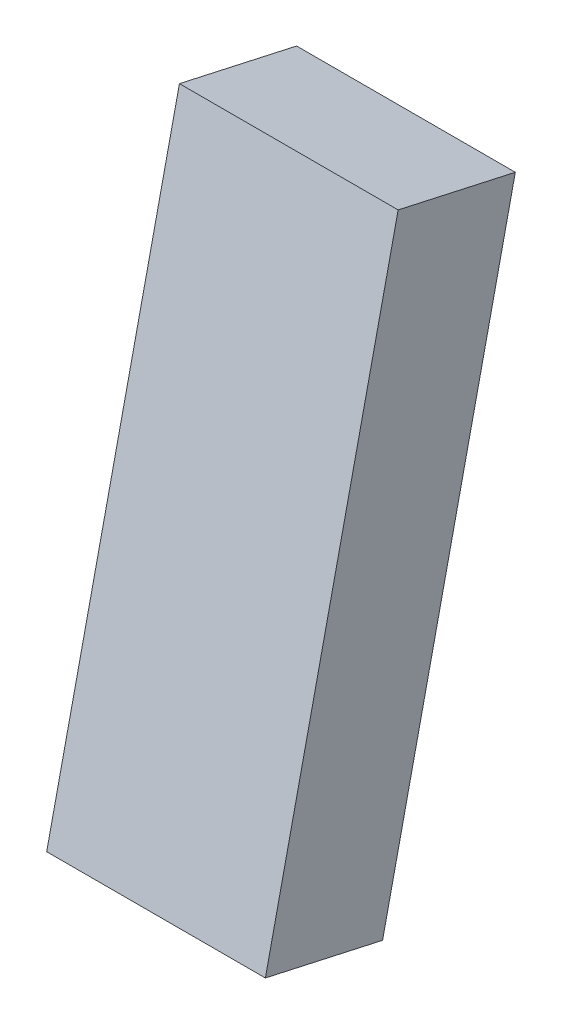
ISO-10303-21;
HEADER;
FILE_DESCRIPTION(('STEP AP214'),'2;1');
FILE_NAME('part.step','',(''),(''),'','','');
FILE_SCHEMA(('AUTOMOTIVE_DESIGN { 1 0 10303 214 1 1 1 1 }'));
ENDSEC;
DATA;
#1=APPLICATION_CONTEXT('core data for automotive mechanical design processes');
#2=APPLICATION_PROTOCOL_DEFINITION('international standard','automotive_design',2000,#1);
#3=PRODUCT_CONTEXT('',#1,'mechanical');
#4=PRODUCT('Part','Part','',(#3));
#5=PRODUCT_RELATED_PRODUCT_CATEGORY('part','',(#4));
#6=PRODUCT_DEFINITION_FORMATION('','',#4);
#7=PRODUCT_DEFINITION_CONTEXT('part definition',#1,'design');
#8=PRODUCT_DEFINITION('design','',#6,#7);
#9=PRODUCT_DEFINITION_SHAPE('','',#8);
#10=(LENGTH_UNIT() NAMED_UNIT(*) SI_UNIT(.MILLI.,.METRE.));
#11=(NAMED_UNIT(*) PLANE_ANGLE_UNIT() SI_UNIT($,.RADIAN.));
#12=(NAMED_UNIT(*) SI_UNIT($,.STERADIAN.) SOLID_ANGLE_UNIT());
#13=UNCERTAINTY_MEASURE_WITH_UNIT(LENGTH_MEASURE(1.E-05),#10,'distance_accuracy_value','');
#14=(GEOMETRIC_REPRESENTATION_CONTEXT(3) GLOBAL_UNCERTAINTY_ASSIGNED_CONTEXT((#13)) GLOBAL_UNIT_ASSIGNED_CONTEXT((#10,
#11,#12)) REPRESENTATION_CONTEXT('',''));
#15=CARTESIAN_POINT('',(0.,0.,0.));
#16=DIRECTION('',(0.,0.,1.));
#17=DIRECTION('',(1.,0.,0.));
#18=AXIS2_PLACEMENT_3D('',#15,#16,#17);
#19=CARTESIAN_POINT('',(-91.25,5.097798026429,-11.80341482376));
#20=DIRECTION('',(0.,-0.216439613938107,-0.976296007119932));
#21=DIRECTION('',(0.,-0.976296007119932,0.216439613938107));
#22=AXIS2_PLACEMENT_3D('',#19,#20,#21);
#23=PLANE('',#22);
#24=CARTESIAN_POINT('',(-100.05,-19.2663142287835,-6.19716527388733));
#25=DIRECTION('',(1.,0.,0.));
#26=VECTOR('',#25,1.);
#27=LINE('',#24,#26);
#28=CARTESIAN_POINT('',(-100.116666666667,-19.1505707354301,-6.29111028955145));
#29=VERTEX_POINT('',#28);
#30=CARTESIAN_POINT('',(-82.383333333333,-19.1505707354311,-6.2911102895521));
#31=VERTEX_POINT('',#30);
#32=EDGE_CURVE('E75',#29,#31,#27,.T.);
#33=ORIENTED_EDGE('',*,*,#32,.F.);
#34=CARTESIAN_POINT('',(-100.25,29.353226925791,-16.9758580480057));
#35=DIRECTION('',(0.,-0.976296007119932,0.216439613938107));
#36=VECTOR('',#35,1.);
#37=LINE('',#34,#36);
#38=CARTESIAN_POINT('',(-100.116666666666,29.4038840186705,-17.0553737560744));
#39=VERTEX_POINT('',#38);
#40=EDGE_CURVE('E58',#39,#29,#37,.T.);
#41=ORIENTED_EDGE('',*,*,#40,.F.);
#42=CARTESIAN_POINT('',(-82.45,29.5484861272167,-17.0191459707915));
#43=DIRECTION('',(-1.,0.,0.));
#44=VECTOR('',#43,1.);
#45=LINE('',#42,#44);
#46=CARTESIAN_POINT('',(-82.3833333333341,29.403884018671,-17.0553737560753));
#47=VERTEX_POINT('',#46);
#48=EDGE_CURVE('E71',#47,#39,#45,.T.);
#49=ORIENTED_EDGE('',*,*,#48,.F.);
#50=CARTESIAN_POINT('',(-82.25,-19.071055027361,-6.24045319667937));
#51=DIRECTION('',(0.,0.976296007119932,-0.216439613938107));
#52=VECTOR('',#51,1.);
#53=LINE('',#50,#52);
#54=EDGE_CURVE('E78',#31,#47,#53,.T.);
#55=ORIENTED_EDGE('',*,*,#54,.F.);
#56=EDGE_LOOP('',(#33,#41,#49,#55));
#57=FACE_BOUND('',#56,.T.);
#58=ADVANCED_FACE('F17',(#57),#23,.T.);
#59=CARTESIAN_POINT('',(-100.25,-17.14520601219,3.370535595888));
#60=DIRECTION('',(-1.,0.,0.));
#61=DIRECTION('',(0.,0.,1.));
#62=AXIS2_PLACEMENT_3D('',#59,#60,#61);
#63=PLANE('',#62);
#64=CARTESIAN_POINT('',(-100.05,-17.1884939349777,3.1752763944635));
#65=DIRECTION('',(0.,-0.216439613938107,-0.976296007119932));
#66=VECTOR('',#65,1.);
#67=LINE('',#64,#66);
#68=CARTESIAN_POINT('',(-100.116666666666,-17.0438918264299,3.21150417974635));
#69=VERTEX_POINT('',#68);
#70=EDGE_CURVE('E63',#69,#29,#67,.T.);
#71=ORIENTED_EDGE('',*,*,#70,.F.);
#72=CARTESIAN_POINT('',(-100.25,-16.9932347335499,3.1319884716764));
#73=DIRECTION('',(0.,0.976296007119932,-0.216439613938107));
#74=VECTOR('',#73,1.);
#75=LINE('',#72,#74);
#76=CARTESIAN_POINT('',(-100.116666666666,31.5105629276674,-7.55275928677459));
#77=VERTEX_POINT('',#76);
#78=EDGE_CURVE('E251',#69,#77,#75,.T.);
#79=ORIENTED_EDGE('',*,*,#78,.T.);
#80=CARTESIAN_POINT('',(-100.05,29.5484861272167,-17.0191459707915));
#81=DIRECTION('',(0.,0.216439613938107,0.976296007119933));
#82=VECTOR('',#81,1.);
#83=LINE('',#80,#82);
#84=EDGE_CURVE('E66',#39,#77,#83,.T.);
#85=ORIENTED_EDGE('',*,*,#84,.F.);
#86=ORIENTED_EDGE('',*,*,#40,.T.);
#87=EDGE_LOOP('',(#71,#79,#85,#86));
#88=FACE_BOUND('',#87,.T.);
#89=ADVANCED_FACE('F61',(#88),#63,.T.);
#90=CARTESIAN_POINT('',(-100.25,31.66959434381,-7.451445101017));
#91=DIRECTION('',(0.,0.976296007119932,-0.216439613938107));
#92=DIRECTION('',(-1.,0.,0.));
#93=AXIS2_PLACEMENT_3D('',#90,#91,#92);
#94=PLANE('',#93);
#95=CARTESIAN_POINT('',(-100.05,31.6263064210223,-7.6467043024415));
#96=DIRECTION('',(1.,0.,0.));
#97=VECTOR('',#96,1.);
#98=LINE('',#95,#97);
#99=CARTESIAN_POINT('',(-82.383333333334,31.5105629276678,-7.55275928677457));
#100=VERTEX_POINT('',#99);
#101=EDGE_CURVE('E217',#77,#100,#98,.T.);
#102=ORIENTED_EDGE('',*,*,#101,.T.);
#103=CARTESIAN_POINT('',(-82.25,29.353226925793,-16.9758580480107));
#104=DIRECTION('',(0.,0.216439613938107,0.976296007119932));
#105=VECTOR('',#104,1.);
#106=LINE('',#103,#105);
#107=EDGE_CURVE('E92',#47,#100,#106,.T.);
#108=ORIENTED_EDGE('',*,*,#107,.F.);
#109=ORIENTED_EDGE('',*,*,#48,.T.);
#110=ORIENTED_EDGE('',*,*,#84,.T.);
#111=EDGE_LOOP('',(#102,#108,#109,#110));
#112=FACE_BOUND('',#111,.T.);
#113=ADVANCED_FACE('F177',(#112),#94,.T.);
#114=CARTESIAN_POINT('',(-82.25,31.66959434381,-7.451445101017));
#115=DIRECTION('',(1.,0.,0.));
#116=DIRECTION('',(0.,1.,0.));
#117=AXIS2_PLACEMENT_3D('',#114,#115,#116);
#118=PLANE('',#117);
#119=ORIENTED_EDGE('',*,*,#54,.T.);
#120=ORIENTED_EDGE('',*,*,#107,.T.);
#121=CARTESIAN_POINT('',(-82.25,31.4310472195999,-7.6034163796544));
#122=DIRECTION('',(0.,-0.976296007119932,0.216439613938107));
#123=VECTOR('',#122,1.);
#124=LINE('',#121,#123);
#125=CARTESIAN_POINT('',(-82.383333333334,-17.0438918264304,3.21150417974663));
#126=VERTEX_POINT('',#125);
#127=EDGE_CURVE('E29',#100,#126,#124,.T.);
#128=ORIENTED_EDGE('',*,*,#127,.T.);
#129=CARTESIAN_POINT('',(-82.45,-19.2663142287835,-6.19716527388733));
#130=DIRECTION('',(0.,0.216439613938107,0.976296007119932));
#131=VECTOR('',#130,1.);
#132=LINE('',#129,#131);
#133=EDGE_CURVE('E83',#31,#126,#132,.T.);
#134=ORIENTED_EDGE('',*,*,#133,.F.);
#135=EDGE_LOOP('',(#119,#120,#128,#134));
#136=FACE_BOUND('',#135,.T.);
#137=ADVANCED_FACE('F111',(#136),#118,.T.);
#138=CARTESIAN_POINT('',(-82.25,-17.14520601219,3.370535595888));
#139=DIRECTION('',(0.,-0.976296007119932,0.216439613938107));
#140=DIRECTION('',(-1.,0.,0.));
#141=AXIS2_PLACEMENT_3D('',#138,#139,#140);
#142=PLANE('',#141);
#143=ORIENTED_EDGE('',*,*,#32,.T.);
#144=ORIENTED_EDGE('',*,*,#133,.T.);
#145=CARTESIAN_POINT('',(-82.45,-17.1884939349777,3.1752763944635));
#146=DIRECTION('',(-1.,0.,0.));
#147=VECTOR('',#146,1.);
#148=LINE('',#145,#147);
#149=EDGE_CURVE('E11',#126,#69,#148,.T.);
#150=ORIENTED_EDGE('',*,*,#149,.T.);
#151=ORIENTED_EDGE('',*,*,#70,.T.);
#152=EDGE_LOOP('',(#143,#144,#150,#151));
#153=FACE_BOUND('',#152,.T.);
#154=ADVANCED_FACE('F87',(#153),#142,.T.);
#155=CARTESIAN_POINT('',(-91.25,7.26219416581,-2.040454752565));
#156=DIRECTION('',(0.,-0.216439613938107,-0.976296007119932));
#157=DIRECTION('',(0.,-0.976296007119932,0.216439613938107));
#158=AXIS2_PLACEMENT_3D('',#155,#156,#157);
#159=PLANE('',#158);
#160=ORIENTED_EDGE('',*,*,#127,.F.);
#161=ORIENTED_EDGE('',*,*,#101,.F.);
#162=ORIENTED_EDGE('',*,*,#78,.F.);
#163=ORIENTED_EDGE('',*,*,#149,.F.);
#164=EDGE_LOOP('',(#160,#161,#162,#163));
#165=FACE_BOUND('',#164,.T.);
#166=ADVANCED_FACE('F110',(#165),#159,.F.);
#167=CLOSED_SHELL('',(#58,#89,#113,#137,#154,#166));
#168=MANIFOLD_SOLID_BREP('B1',#167);
#169=ADVANCED_BREP_SHAPE_REPRESENTATION('',(#18,#168),#14);
#170=SHAPE_DEFINITION_REPRESENTATION(#9,#169);
ENDSEC;
END-ISO-10303-21;
